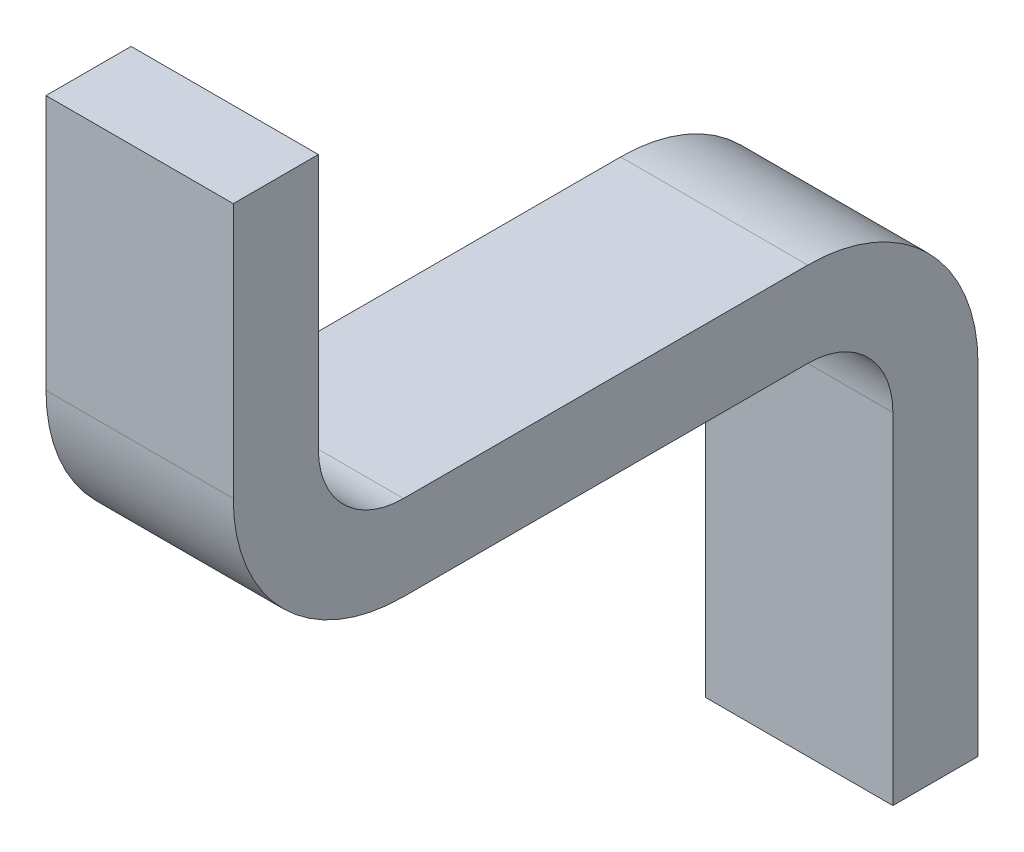
ISO-10303-21;
HEADER;
FILE_DESCRIPTION(('STEP AP214'),'2;1');
FILE_NAME('part.step','',(''),(''),'','','');
FILE_SCHEMA(('AUTOMOTIVE_DESIGN { 1 0 10303 214 1 1 1 1 }'));
ENDSEC;
DATA;
#1=APPLICATION_CONTEXT('core data for automotive mechanical design processes');
#2=APPLICATION_PROTOCOL_DEFINITION('international standard','automotive_design',2000,#1);
#3=PRODUCT_CONTEXT('',#1,'mechanical');
#4=PRODUCT('Part','Part','',(#3));
#5=PRODUCT_RELATED_PRODUCT_CATEGORY('part','',(#4));
#6=PRODUCT_DEFINITION_FORMATION('','',#4);
#7=PRODUCT_DEFINITION_CONTEXT('part definition',#1,'design');
#8=PRODUCT_DEFINITION('design','',#6,#7);
#9=PRODUCT_DEFINITION_SHAPE('','',#8);
#10=(LENGTH_UNIT() NAMED_UNIT(*) SI_UNIT(.MILLI.,.METRE.));
#11=(NAMED_UNIT(*) PLANE_ANGLE_UNIT() SI_UNIT($,.RADIAN.));
#12=(NAMED_UNIT(*) SI_UNIT($,.STERADIAN.) SOLID_ANGLE_UNIT());
#13=UNCERTAINTY_MEASURE_WITH_UNIT(LENGTH_MEASURE(1.E-05),#10,'distance_accuracy_value','');
#14=(GEOMETRIC_REPRESENTATION_CONTEXT(3) GLOBAL_UNCERTAINTY_ASSIGNED_CONTEXT((#13)) GLOBAL_UNIT_ASSIGNED_CONTEXT((#10,
#11,#12)) REPRESENTATION_CONTEXT('',''));
#15=CARTESIAN_POINT('',(0.,0.,0.));
#16=DIRECTION('',(0.,0.,1.));
#17=DIRECTION('',(1.,0.,0.));
#18=AXIS2_PLACEMENT_3D('',#15,#16,#17);
#19=CARTESIAN_POINT('',(2.14,-4.,0.675));
#20=DIRECTION('',(1.,0.,0.));
#21=DIRECTION('',(0.,1.,0.));
#22=AXIS2_PLACEMENT_3D('',#19,#20,#21);
#23=PLANE('',#22);
#24=CARTESIAN_POINT('',(2.14,-3.8,0.675));
#25=DIRECTION('',(-1.,0.,0.));
#26=DIRECTION('',(0.,-1.,0.));
#27=AXIS2_PLACEMENT_3D('',#24,#25,#26);
#28=CIRCLE('',#27,0.2);
#29=CARTESIAN_POINT('',(2.14,-3.8,0.875));
#30=VERTEX_POINT('',#29);
#31=CARTESIAN_POINT('',(2.14,-4.,0.675));
#32=VERTEX_POINT('',#31);
#33=EDGE_CURVE('E150',#30,#32,#28,.F.);
#34=ORIENTED_EDGE('',*,*,#33,.F.);
#35=DIRECTION('',(0.,1.,0.));
#36=VECTOR('',#35,1.);
#37=CARTESIAN_POINT('',(2.14,-3.5,0.875));
#38=LINE('',#37,#36);
#39=CARTESIAN_POINT('',(2.14,-3.5,0.875));
#40=VERTEX_POINT('',#39);
#41=EDGE_CURVE('E147',#30,#40,#38,.T.);
#42=ORIENTED_EDGE('',*,*,#41,.T.);
#43=DIRECTION('',(0.,0.,1.));
#44=VECTOR('',#43,1.);
#45=CARTESIAN_POINT('',(2.14,-3.5,0.775));
#46=LINE('',#45,#44);
#47=CARTESIAN_POINT('',(2.14,-3.5,0.775));
#48=VERTEX_POINT('',#47);
#49=EDGE_CURVE('E141',#48,#40,#46,.T.);
#50=ORIENTED_EDGE('',*,*,#49,.F.);
#51=DIRECTION('',(0.,1.,0.));
#52=VECTOR('',#51,1.);
#53=CARTESIAN_POINT('',(2.14,-3.5,0.775));
#54=LINE('',#53,#52);
#55=CARTESIAN_POINT('',(2.14,-3.8,0.775));
#56=VERTEX_POINT('',#55);
#57=EDGE_CURVE('E115',#48,#56,#54,.F.);
#58=ORIENTED_EDGE('',*,*,#57,.T.);
#59=CARTESIAN_POINT('',(2.14,-3.8,0.675));
#60=DIRECTION('',(-1.,0.,0.));
#61=DIRECTION('',(0.,-1.,0.));
#62=AXIS2_PLACEMENT_3D('',#59,#60,#61);
#63=CIRCLE('',#62,0.1);
#64=CARTESIAN_POINT('',(2.14,-3.9,0.675));
#65=VERTEX_POINT('',#64);
#66=EDGE_CURVE('E215',#56,#65,#63,.F.);
#67=ORIENTED_EDGE('',*,*,#66,.T.);
#68=DIRECTION('',(0.,0.,1.));
#69=VECTOR('',#68,1.);
#70=CARTESIAN_POINT('',(2.14,-3.9,0.675));
#71=LINE('',#70,#69);
#72=CARTESIAN_POINT('',(2.14,-3.9,0.2));
#73=VERTEX_POINT('',#72);
#74=EDGE_CURVE('E181',#65,#73,#71,.F.);
#75=ORIENTED_EDGE('',*,*,#74,.T.);
#76=CARTESIAN_POINT('',(2.14,-4.1,0.2));
#77=DIRECTION('',(1.,0.,0.));
#78=DIRECTION('',(0.,1.,0.));
#79=AXIS2_PLACEMENT_3D('',#76,#77,#78);
#80=CIRCLE('',#79,0.2);
#81=CARTESIAN_POINT('',(2.14,-4.1,0.));
#82=VERTEX_POINT('',#81);
#83=EDGE_CURVE('E20',#82,#73,#80,.T.);
#84=ORIENTED_EDGE('',*,*,#83,.F.);
#85=DIRECTION('',(0.,1.,0.));
#86=VECTOR('',#85,1.);
#87=CARTESIAN_POINT('',(2.14,-4.1,0.));
#88=LINE('',#87,#86);
#89=CARTESIAN_POINT('',(2.14,-4.5,0.));
#90=VERTEX_POINT('',#89);
#91=EDGE_CURVE('E91',#82,#90,#88,.F.);
#92=ORIENTED_EDGE('',*,*,#91,.T.);
#93=DIRECTION('',(0.,0.,1.));
#94=VECTOR('',#93,1.);
#95=CARTESIAN_POINT('',(2.14,-4.5,0.));
#96=LINE('',#95,#94);
#97=CARTESIAN_POINT('',(2.14,-4.5,0.1));
#98=VERTEX_POINT('',#97);
#99=EDGE_CURVE('E163',#90,#98,#96,.T.);
#100=ORIENTED_EDGE('',*,*,#99,.T.);
#101=DIRECTION('',(0.,1.,0.));
#102=VECTOR('',#101,1.);
#103=CARTESIAN_POINT('',(2.14,-4.1,0.1));
#104=LINE('',#103,#102);
#105=CARTESIAN_POINT('',(2.14,-4.1,0.1));
#106=VERTEX_POINT('',#105);
#107=EDGE_CURVE('E159',#98,#106,#104,.T.);
#108=ORIENTED_EDGE('',*,*,#107,.T.);
#109=CARTESIAN_POINT('',(2.14,-4.1,0.2));
#110=DIRECTION('',(1.,0.,0.));
#111=DIRECTION('',(0.,1.,0.));
#112=AXIS2_PLACEMENT_3D('',#109,#110,#111);
#113=CIRCLE('',#112,0.1);
#114=CARTESIAN_POINT('',(2.14,-4.,0.2));
#115=VERTEX_POINT('',#114);
#116=EDGE_CURVE('E155',#106,#115,#113,.T.);
#117=ORIENTED_EDGE('',*,*,#116,.T.);
#118=DIRECTION('',(0.,0.,1.));
#119=VECTOR('',#118,1.);
#120=CARTESIAN_POINT('',(2.14,-4.,0.675));
#121=LINE('',#120,#119);
#122=EDGE_CURVE('E154',#115,#32,#121,.T.);
#123=ORIENTED_EDGE('',*,*,#122,.T.);
#124=EDGE_LOOP('',(#34,#42,#50,#58,#67,#75,#84,#92,#100,#108,#117,#123));
#125=FACE_BOUND('',#124,.T.);
#126=ADVANCED_FACE('F17',(#125),#23,.F.);
#127=CARTESIAN_POINT('',(2.14,-4.1,0.2));
#128=DIRECTION('',(1.,0.,0.));
#129=DIRECTION('',(0.,1.,0.));
#130=AXIS2_PLACEMENT_3D('',#127,#128,#129);
#131=CYLINDRICAL_SURFACE('',#130,0.2);
#132=CARTESIAN_POINT('',(2.36,-4.1,0.2));
#133=DIRECTION('',(1.,0.,0.));
#134=DIRECTION('',(0.,1.,0.));
#135=AXIS2_PLACEMENT_3D('',#132,#133,#134);
#136=CIRCLE('',#135,0.2);
#137=CARTESIAN_POINT('',(2.36,-3.9,0.2));
#138=VERTEX_POINT('',#137);
#139=CARTESIAN_POINT('',(2.36,-4.1,0.));
#140=VERTEX_POINT('',#139);
#141=EDGE_CURVE('E183',#138,#140,#136,.F.);
#142=ORIENTED_EDGE('',*,*,#141,.T.);
#143=DIRECTION('',(1.,0.,0.));
#144=VECTOR('',#143,1.);
#145=CARTESIAN_POINT('',(2.14,-4.1,0.));
#146=LINE('',#145,#144);
#147=EDGE_CURVE('E178',#140,#82,#146,.F.);
#148=ORIENTED_EDGE('',*,*,#147,.T.);
#149=ORIENTED_EDGE('',*,*,#83,.T.);
#150=DIRECTION('',(1.,0.,0.));
#151=VECTOR('',#150,1.);
#152=CARTESIAN_POINT('',(2.14,-3.9,0.2));
#153=LINE('',#152,#151);
#154=EDGE_CURVE('E217',#73,#138,#153,.T.);
#155=ORIENTED_EDGE('',*,*,#154,.T.);
#156=EDGE_LOOP('',(#142,#148,#149,#155));
#157=FACE_BOUND('',#156,.T.);
#158=ADVANCED_FACE('F254',(#157),#131,.T.);
#159=CARTESIAN_POINT('',(2.14,-4.1,0.));
#160=DIRECTION('',(0.,0.,1.));
#161=DIRECTION('',(1.,0.,0.));
#162=AXIS2_PLACEMENT_3D('',#159,#160,#161);
#163=PLANE('',#162);
#164=ORIENTED_EDGE('',*,*,#147,.F.);
#165=DIRECTION('',(0.,-1.,0.));
#166=VECTOR('',#165,1.);
#167=CARTESIAN_POINT('',(2.36,-3.9,0.));
#168=LINE('',#167,#166);
#169=CARTESIAN_POINT('',(2.36,-4.5,0.));
#170=VERTEX_POINT('',#169);
#171=EDGE_CURVE('E170',#140,#170,#168,.T.);
#172=ORIENTED_EDGE('',*,*,#171,.T.);
#173=DIRECTION('',(-1.,0.,0.));
#174=VECTOR('',#173,1.);
#175=CARTESIAN_POINT('',(2.14,-4.5,0.));
#176=LINE('',#175,#174);
#177=EDGE_CURVE('E173',#170,#90,#176,.T.);
#178=ORIENTED_EDGE('',*,*,#177,.T.);
#179=ORIENTED_EDGE('',*,*,#91,.F.);
#180=EDGE_LOOP('',(#164,#172,#178,#179));
#181=FACE_BOUND('',#180,.T.);
#182=ADVANCED_FACE('F257',(#181),#163,.F.);
#183=CARTESIAN_POINT('',(2.14,-4.5,0.));
#184=DIRECTION('',(0.,1.,0.));
#185=DIRECTION('',(-1.,0.,0.));
#186=AXIS2_PLACEMENT_3D('',#183,#184,#185);
#187=PLANE('',#186);
#188=DIRECTION('',(-1.,0.,0.));
#189=VECTOR('',#188,1.);
#190=CARTESIAN_POINT('',(2.36,-4.5,0.1));
#191=LINE('',#190,#189);
#192=CARTESIAN_POINT('',(2.36,-4.5,0.1));
#193=VERTEX_POINT('',#192);
#194=EDGE_CURVE('E160',#193,#98,#191,.T.);
#195=ORIENTED_EDGE('',*,*,#194,.T.);
#196=ORIENTED_EDGE('',*,*,#99,.F.);
#197=ORIENTED_EDGE('',*,*,#177,.F.);
#198=DIRECTION('',(0.,0.,1.));
#199=VECTOR('',#198,1.);
#200=CARTESIAN_POINT('',(2.36,-4.5,0.675));
#201=LINE('',#200,#199);
#202=EDGE_CURVE('E166',#170,#193,#201,.T.);
#203=ORIENTED_EDGE('',*,*,#202,.T.);
#204=EDGE_LOOP('',(#195,#196,#197,#203));
#205=FACE_BOUND('',#204,.T.);
#206=ADVANCED_FACE('F259',(#205),#187,.F.);
#207=CARTESIAN_POINT('',(2.36,-4.1,0.1));
#208=DIRECTION('',(0.,0.,-1.));
#209=DIRECTION('',(-1.,0.,0.));
#210=AXIS2_PLACEMENT_3D('',#207,#208,#209);
#211=PLANE('',#210);
#212=DIRECTION('',(1.,0.,0.));
#213=VECTOR('',#212,1.);
#214=CARTESIAN_POINT('',(2.36,-4.1,0.1));
#215=LINE('',#214,#213);
#216=CARTESIAN_POINT('',(2.36,-4.1,0.1));
#217=VERTEX_POINT('',#216);
#218=EDGE_CURVE('E156',#217,#106,#215,.F.);
#219=ORIENTED_EDGE('',*,*,#218,.T.);
#220=ORIENTED_EDGE('',*,*,#107,.F.);
#221=ORIENTED_EDGE('',*,*,#194,.F.);
#222=DIRECTION('',(0.,-1.,0.));
#223=VECTOR('',#222,1.);
#224=CARTESIAN_POINT('',(2.36,-3.9,0.1));
#225=LINE('',#224,#223);
#226=EDGE_CURVE('E169',#193,#217,#225,.F.);
#227=ORIENTED_EDGE('',*,*,#226,.T.);
#228=EDGE_LOOP('',(#219,#220,#221,#227));
#229=FACE_BOUND('',#228,.T.);
#230=ADVANCED_FACE('F234',(#229),#211,.F.);
#231=CARTESIAN_POINT('',(2.36,-4.1,0.2));
#232=DIRECTION('',(1.,0.,0.));
#233=DIRECTION('',(0.,1.,0.));
#234=AXIS2_PLACEMENT_3D('',#231,#232,#233);
#235=CYLINDRICAL_SURFACE('',#234,0.1);
#236=DIRECTION('',(-1.,0.,0.));
#237=VECTOR('',#236,1.);
#238=CARTESIAN_POINT('',(2.36,-4.,0.2));
#239=LINE('',#238,#237);
#240=CARTESIAN_POINT('',(2.36,-4.,0.2));
#241=VERTEX_POINT('',#240);
#242=EDGE_CURVE('E151',#241,#115,#239,.T.);
#243=ORIENTED_EDGE('',*,*,#242,.T.);
#244=ORIENTED_EDGE('',*,*,#116,.F.);
#245=ORIENTED_EDGE('',*,*,#218,.F.);
#246=CARTESIAN_POINT('',(2.36,-4.1,0.2));
#247=DIRECTION('',(1.,0.,0.));
#248=DIRECTION('',(0.,1.,0.));
#249=AXIS2_PLACEMENT_3D('',#246,#247,#248);
#250=CIRCLE('',#249,0.1);
#251=EDGE_CURVE('E210',#217,#241,#250,.T.);
#252=ORIENTED_EDGE('',*,*,#251,.T.);
#253=EDGE_LOOP('',(#243,#244,#245,#252));
#254=FACE_BOUND('',#253,.T.);
#255=ADVANCED_FACE('F227',(#254),#235,.F.);
#256=CARTESIAN_POINT('',(2.36,-4.,0.675));
#257=DIRECTION('',(0.,1.,0.));
#258=DIRECTION('',(-1.,0.,0.));
#259=AXIS2_PLACEMENT_3D('',#256,#257,#258);
#260=PLANE('',#259);
#261=DIRECTION('',(-1.,0.,0.));
#262=VECTOR('',#261,1.);
#263=CARTESIAN_POINT('',(2.36,-4.,0.675));
#264=LINE('',#263,#262);
#265=CARTESIAN_POINT('',(2.36,-4.,0.675));
#266=VERTEX_POINT('',#265);
#267=EDGE_CURVE('E148',#32,#266,#264,.F.);
#268=ORIENTED_EDGE('',*,*,#267,.F.);
#269=ORIENTED_EDGE('',*,*,#122,.F.);
#270=ORIENTED_EDGE('',*,*,#242,.F.);
#271=DIRECTION('',(0.,0.,1.));
#272=VECTOR('',#271,1.);
#273=CARTESIAN_POINT('',(2.36,-4.,0.675));
#274=LINE('',#273,#272);
#275=EDGE_CURVE('E209',#241,#266,#274,.T.);
#276=ORIENTED_EDGE('',*,*,#275,.T.);
#277=EDGE_LOOP('',(#268,#269,#270,#276));
#278=FACE_BOUND('',#277,.T.);
#279=ADVANCED_FACE('F224',(#278),#260,.F.);
#280=CARTESIAN_POINT('',(2.36,-3.8,0.675));
#281=DIRECTION('',(-1.,0.,0.));
#282=DIRECTION('',(0.,-1.,0.));
#283=AXIS2_PLACEMENT_3D('',#280,#281,#282);
#284=CYLINDRICAL_SURFACE('',#283,0.2);
#285=ORIENTED_EDGE('',*,*,#33,.T.);
#286=ORIENTED_EDGE('',*,*,#267,.T.);
#287=CARTESIAN_POINT('',(2.36,-3.8,0.675));
#288=DIRECTION('',(-1.,0.,0.));
#289=DIRECTION('',(0.,-1.,0.));
#290=AXIS2_PLACEMENT_3D('',#287,#288,#289);
#291=CIRCLE('',#290,0.2);
#292=CARTESIAN_POINT('',(2.36,-3.8,0.875));
#293=VERTEX_POINT('',#292);
#294=EDGE_CURVE('E133',#266,#293,#291,.T.);
#295=ORIENTED_EDGE('',*,*,#294,.T.);
#296=DIRECTION('',(-1.,0.,0.));
#297=VECTOR('',#296,1.);
#298=CARTESIAN_POINT('',(2.36,-3.8,0.875));
#299=LINE('',#298,#297);
#300=EDGE_CURVE('E144',#293,#30,#299,.T.);
#301=ORIENTED_EDGE('',*,*,#300,.T.);
#302=EDGE_LOOP('',(#285,#286,#295,#301));
#303=FACE_BOUND('',#302,.T.);
#304=ADVANCED_FACE('F285',(#303),#284,.T.);
#305=CARTESIAN_POINT('',(2.36,-3.5,0.875));
#306=DIRECTION('',(0.,0.,-1.));
#307=DIRECTION('',(-1.,0.,0.));
#308=AXIS2_PLACEMENT_3D('',#305,#306,#307);
#309=PLANE('',#308);
#310=DIRECTION('',(-1.,0.,0.));
#311=VECTOR('',#310,1.);
#312=CARTESIAN_POINT('',(2.14,-3.5,0.875));
#313=LINE('',#312,#311);
#314=CARTESIAN_POINT('',(2.36,-3.5,0.875));
#315=VERTEX_POINT('',#314);
#316=EDGE_CURVE('E118',#40,#315,#313,.F.);
#317=ORIENTED_EDGE('',*,*,#316,.F.);
#318=ORIENTED_EDGE('',*,*,#41,.F.);
#319=ORIENTED_EDGE('',*,*,#300,.F.);
#320=DIRECTION('',(0.,-1.,0.));
#321=VECTOR('',#320,1.);
#322=CARTESIAN_POINT('',(2.36,-3.9,0.875));
#323=LINE('',#322,#321);
#324=EDGE_CURVE('E131',#293,#315,#323,.F.);
#325=ORIENTED_EDGE('',*,*,#324,.T.);
#326=EDGE_LOOP('',(#317,#318,#319,#325));
#327=FACE_BOUND('',#326,.T.);
#328=ADVANCED_FACE('F282',(#327),#309,.F.);
#329=CARTESIAN_POINT('',(2.14,-3.5,0.775));
#330=DIRECTION('',(0.,1.,0.));
#331=DIRECTION('',(-1.,0.,0.));
#332=AXIS2_PLACEMENT_3D('',#329,#330,#331);
#333=PLANE('',#332);
#334=ORIENTED_EDGE('',*,*,#49,.T.);
#335=ORIENTED_EDGE('',*,*,#316,.T.);
#336=DIRECTION('',(0.,0.,1.));
#337=VECTOR('',#336,1.);
#338=CARTESIAN_POINT('',(2.36,-3.5,0.675));
#339=LINE('',#338,#337);
#340=CARTESIAN_POINT('',(2.36,-3.5,0.775));
#341=VERTEX_POINT('',#340);
#342=EDGE_CURVE('E125',#315,#341,#339,.F.);
#343=ORIENTED_EDGE('',*,*,#342,.T.);
#344=DIRECTION('',(1.,0.,0.));
#345=VECTOR('',#344,1.);
#346=CARTESIAN_POINT('',(2.14,-3.5,0.775));
#347=LINE('',#346,#345);
#348=EDGE_CURVE('E110',#341,#48,#347,.F.);
#349=ORIENTED_EDGE('',*,*,#348,.T.);
#350=EDGE_LOOP('',(#334,#335,#343,#349));
#351=FACE_BOUND('',#350,.T.);
#352=ADVANCED_FACE('F129',(#351),#333,.T.);
#353=CARTESIAN_POINT('',(2.14,-3.5,0.775));
#354=DIRECTION('',(0.,0.,1.));
#355=DIRECTION('',(1.,0.,0.));
#356=AXIS2_PLACEMENT_3D('',#353,#354,#355);
#357=PLANE('',#356);
#358=ORIENTED_EDGE('',*,*,#348,.F.);
#359=DIRECTION('',(0.,-1.,0.));
#360=VECTOR('',#359,1.);
#361=CARTESIAN_POINT('',(2.36,-3.9,0.775));
#362=LINE('',#361,#360);
#363=CARTESIAN_POINT('',(2.36,-3.8,0.775));
#364=VERTEX_POINT('',#363);
#365=EDGE_CURVE('E114',#341,#364,#362,.T.);
#366=ORIENTED_EDGE('',*,*,#365,.T.);
#367=DIRECTION('',(-1.,0.,0.));
#368=VECTOR('',#367,1.);
#369=CARTESIAN_POINT('',(2.14,-3.8,0.775));
#370=LINE('',#369,#368);
#371=EDGE_CURVE('E185',#364,#56,#370,.T.);
#372=ORIENTED_EDGE('',*,*,#371,.T.);
#373=ORIENTED_EDGE('',*,*,#57,.F.);
#374=EDGE_LOOP('',(#358,#366,#372,#373));
#375=FACE_BOUND('',#374,.T.);
#376=ADVANCED_FACE('F112',(#375),#357,.F.);
#377=CARTESIAN_POINT('',(2.14,-3.8,0.675));
#378=DIRECTION('',(-1.,0.,0.));
#379=DIRECTION('',(0.,-1.,0.));
#380=AXIS2_PLACEMENT_3D('',#377,#378,#379);
#381=CYLINDRICAL_SURFACE('',#380,0.1);
#382=ORIENTED_EDGE('',*,*,#371,.F.);
#383=CARTESIAN_POINT('',(2.36,-3.8,0.675));
#384=DIRECTION('',(-1.,0.,0.));
#385=DIRECTION('',(0.,-1.,0.));
#386=AXIS2_PLACEMENT_3D('',#383,#384,#385);
#387=CIRCLE('',#386,0.1);
#388=CARTESIAN_POINT('',(2.36,-3.9,0.675));
#389=VERTEX_POINT('',#388);
#390=EDGE_CURVE('E26',#364,#389,#387,.F.);
#391=ORIENTED_EDGE('',*,*,#390,.T.);
#392=DIRECTION('',(1.,0.,0.));
#393=VECTOR('',#392,1.);
#394=CARTESIAN_POINT('',(2.14,-3.9,0.675));
#395=LINE('',#394,#393);
#396=EDGE_CURVE('E34',#389,#65,#395,.F.);
#397=ORIENTED_EDGE('',*,*,#396,.T.);
#398=ORIENTED_EDGE('',*,*,#66,.F.);
#399=EDGE_LOOP('',(#382,#391,#397,#398));
#400=FACE_BOUND('',#399,.T.);
#401=ADVANCED_FACE('F250',(#400),#381,.F.);
#402=CARTESIAN_POINT('',(2.14,-3.9,0.675));
#403=DIRECTION('',(0.,-1.,0.));
#404=DIRECTION('',(1.,0.,0.));
#405=AXIS2_PLACEMENT_3D('',#402,#403,#404);
#406=PLANE('',#405);
#407=ORIENTED_EDGE('',*,*,#396,.F.);
#408=DIRECTION('',(0.,0.,1.));
#409=VECTOR('',#408,1.);
#410=CARTESIAN_POINT('',(2.36,-3.9,0.675));
#411=LINE('',#410,#409);
#412=EDGE_CURVE('E11',#389,#138,#411,.F.);
#413=ORIENTED_EDGE('',*,*,#412,.T.);
#414=ORIENTED_EDGE('',*,*,#154,.F.);
#415=ORIENTED_EDGE('',*,*,#74,.F.);
#416=EDGE_LOOP('',(#407,#413,#414,#415));
#417=FACE_BOUND('',#416,.T.);
#418=ADVANCED_FACE('F252',(#417),#406,.F.);
#419=CARTESIAN_POINT('',(2.36,-3.9,0.675));
#420=DIRECTION('',(-1.,0.,0.));
#421=DIRECTION('',(0.,-1.,0.));
#422=AXIS2_PLACEMENT_3D('',#419,#420,#421);
#423=PLANE('',#422);
#424=ORIENTED_EDGE('',*,*,#390,.F.);
#425=ORIENTED_EDGE('',*,*,#365,.F.);
#426=ORIENTED_EDGE('',*,*,#342,.F.);
#427=ORIENTED_EDGE('',*,*,#324,.F.);
#428=ORIENTED_EDGE('',*,*,#294,.F.);
#429=ORIENTED_EDGE('',*,*,#275,.F.);
#430=ORIENTED_EDGE('',*,*,#251,.F.);
#431=ORIENTED_EDGE('',*,*,#226,.F.);
#432=ORIENTED_EDGE('',*,*,#202,.F.);
#433=ORIENTED_EDGE('',*,*,#171,.F.);
#434=ORIENTED_EDGE('',*,*,#141,.F.);
#435=ORIENTED_EDGE('',*,*,#412,.F.);
#436=EDGE_LOOP('',(#424,#425,#426,#427,#428,#429,#430,#431,#432,#433,#434,#435));
#437=FACE_BOUND('',#436,.T.);
#438=ADVANCED_FACE('F123',(#437),#423,.F.);
#439=CLOSED_SHELL('',(#126,#158,#182,#206,#230,#255,#279,#304,#328,#352,#376,#401,#418,#438));
#440=MANIFOLD_SOLID_BREP('B1',#439);
#441=ADVANCED_BREP_SHAPE_REPRESENTATION('',(#18,#440),#14);
#442=SHAPE_DEFINITION_REPRESENTATION(#9,#441);
ENDSEC;
END-ISO-10303-21;
